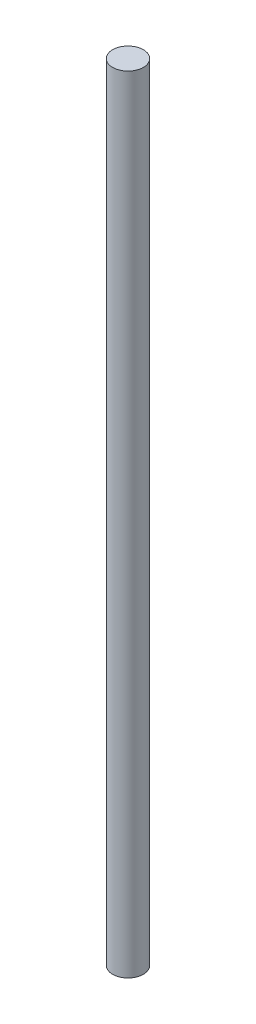
ISO-10303-21;
HEADER;
FILE_DESCRIPTION(('STEP AP214'),'2;1');
FILE_NAME('part.step','',(''),(''),'','','');
FILE_SCHEMA(('AUTOMOTIVE_DESIGN { 1 0 10303 214 1 1 1 1 }'));
ENDSEC;
DATA;
#1=APPLICATION_CONTEXT('core data for automotive mechanical design processes');
#2=APPLICATION_PROTOCOL_DEFINITION('international standard','automotive_design',2000,#1);
#3=PRODUCT_CONTEXT('',#1,'mechanical');
#4=PRODUCT('Part','Part','',(#3));
#5=PRODUCT_RELATED_PRODUCT_CATEGORY('part','',(#4));
#6=PRODUCT_DEFINITION_FORMATION('','',#4);
#7=PRODUCT_DEFINITION_CONTEXT('part definition',#1,'design');
#8=PRODUCT_DEFINITION('design','',#6,#7);
#9=PRODUCT_DEFINITION_SHAPE('','',#8);
#10=(LENGTH_UNIT() NAMED_UNIT(*) SI_UNIT(.MILLI.,.METRE.));
#11=(NAMED_UNIT(*) PLANE_ANGLE_UNIT() SI_UNIT($,.RADIAN.));
#12=(NAMED_UNIT(*) SI_UNIT($,.STERADIAN.) SOLID_ANGLE_UNIT());
#13=UNCERTAINTY_MEASURE_WITH_UNIT(LENGTH_MEASURE(1.E-05),#10,'distance_accuracy_value','');
#14=(GEOMETRIC_REPRESENTATION_CONTEXT(3) GLOBAL_UNCERTAINTY_ASSIGNED_CONTEXT((#13)) GLOBAL_UNIT_ASSIGNED_CONTEXT((#10,
#11,#12)) REPRESENTATION_CONTEXT('',''));
#15=CARTESIAN_POINT('',(0.,0.,0.));
#16=DIRECTION('',(0.,0.,1.));
#17=DIRECTION('',(1.,0.,0.));
#18=AXIS2_PLACEMENT_3D('',#15,#16,#17);
#19=CARTESIAN_POINT('',(-2.25775596922577,-230.,-0.995085038288394));
#20=DIRECTION('',(0.,1.,0.));
#21=DIRECTION('',(0.,0.,1.));
#22=AXIS2_PLACEMENT_3D('',#19,#20,#21);
#23=CYLINDRICAL_SURFACE('',#22,4.5);
#24=CARTESIAN_POINT('',(-2.25775596922577,-230.,-0.995085038288394));
#25=DIRECTION('',(0.,1.,0.));
#26=DIRECTION('',(0.,0.,1.));
#27=AXIS2_PLACEMENT_3D('',#24,#25,#26);
#28=CIRCLE('',#27,4.5);
#29=CARTESIAN_POINT('',(-2.25775596922577,-230.,3.50491496171161));
#30=VERTEX_POINT('',#29);
#31=EDGE_CURVE('E10',#30,#30,#28,.T.);
#32=ORIENTED_EDGE('',*,*,#31,.T.);
#33=EDGE_LOOP('',(#32));
#34=FACE_BOUND('',#33,.T.);
#35=CARTESIAN_POINT('',(-2.25775596922577,0.,-0.995085038288394));
#36=DIRECTION('',(0.,1.,0.));
#37=DIRECTION('',(0.,0.,1.));
#38=AXIS2_PLACEMENT_3D('',#35,#36,#37);
#39=CIRCLE('',#38,4.5);
#40=CARTESIAN_POINT('',(-2.25775596922577,0.,3.50491496171161));
#41=VERTEX_POINT('',#40);
#42=EDGE_CURVE('E34',#41,#41,#39,.T.);
#43=ORIENTED_EDGE('',*,*,#42,.F.);
#44=EDGE_LOOP('',(#43));
#45=FACE_BOUND('',#44,.T.);
#46=ADVANCED_FACE('F31',(#34,#45),#23,.T.);
#47=CARTESIAN_POINT('',(-2.25775596922577,-230.,-0.995085038288394));
#48=DIRECTION('',(0.,1.,0.));
#49=DIRECTION('',(0.,0.,1.));
#50=AXIS2_PLACEMENT_3D('',#47,#48,#49);
#51=PLANE('',#50);
#52=ORIENTED_EDGE('',*,*,#31,.F.);
#53=EDGE_LOOP('',(#52));
#54=FACE_BOUND('',#53,.T.);
#55=ADVANCED_FACE('F46',(#54),#51,.F.);
#56=CARTESIAN_POINT('',(-2.25775596922577,0.,-0.995085038288394));
#57=DIRECTION('',(0.,1.,0.));
#58=DIRECTION('',(0.,0.,1.));
#59=AXIS2_PLACEMENT_3D('',#56,#57,#58);
#60=PLANE('',#59);
#61=ORIENTED_EDGE('',*,*,#42,.T.);
#62=EDGE_LOOP('',(#61));
#63=FACE_BOUND('',#62,.T.);
#64=ADVANCED_FACE('F43',(#63),#60,.T.);
#65=CLOSED_SHELL('',(#46,#55,#64));
#66=MANIFOLD_SOLID_BREP('B2',#65);
#67=ADVANCED_BREP_SHAPE_REPRESENTATION('',(#18,#66),#14);
#68=SHAPE_DEFINITION_REPRESENTATION(#9,#67);
ENDSEC;
END-ISO-10303-21;
